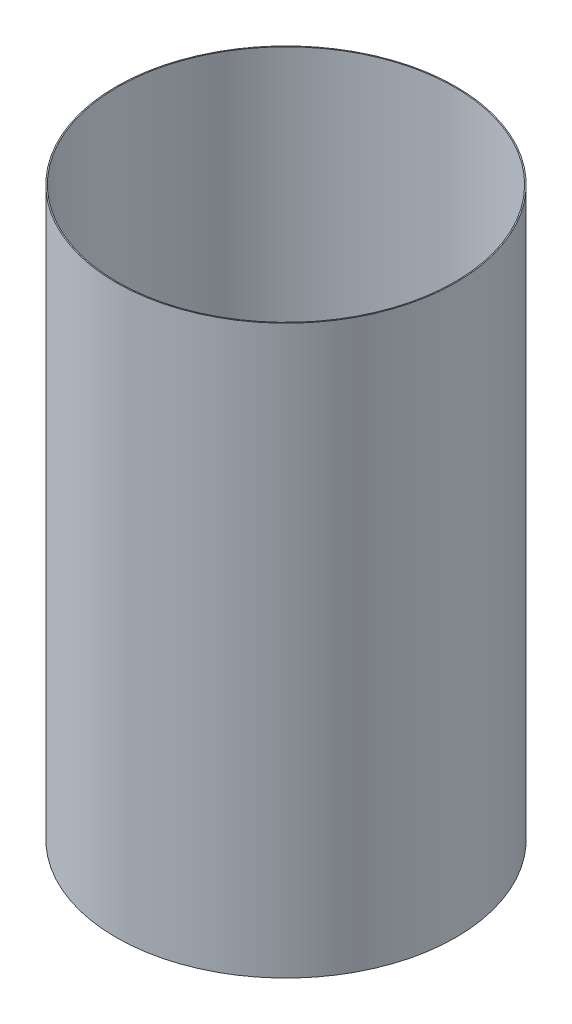
ISO-10303-21;
HEADER;
FILE_DESCRIPTION(('STEP AP214'),'2;1');
FILE_NAME('part.step','',(''),(''),'','','');
FILE_SCHEMA(('AUTOMOTIVE_DESIGN { 1 0 10303 214 1 1 1 1 }'));
ENDSEC;
DATA;
#1=APPLICATION_CONTEXT('core data for automotive mechanical design processes');
#2=APPLICATION_PROTOCOL_DEFINITION('international standard','automotive_design',2000,#1);
#3=PRODUCT_CONTEXT('',#1,'mechanical');
#4=PRODUCT('Part','Part','',(#3));
#5=PRODUCT_RELATED_PRODUCT_CATEGORY('part','',(#4));
#6=PRODUCT_DEFINITION_FORMATION('','',#4);
#7=PRODUCT_DEFINITION_CONTEXT('part definition',#1,'design');
#8=PRODUCT_DEFINITION('design','',#6,#7);
#9=PRODUCT_DEFINITION_SHAPE('','',#8);
#10=(LENGTH_UNIT() NAMED_UNIT(*) SI_UNIT(.MILLI.,.METRE.));
#11=(NAMED_UNIT(*) PLANE_ANGLE_UNIT() SI_UNIT($,.RADIAN.));
#12=(NAMED_UNIT(*) SI_UNIT($,.STERADIAN.) SOLID_ANGLE_UNIT());
#13=UNCERTAINTY_MEASURE_WITH_UNIT(LENGTH_MEASURE(1.E-05),#10,'distance_accuracy_value','');
#14=(GEOMETRIC_REPRESENTATION_CONTEXT(3) GLOBAL_UNCERTAINTY_ASSIGNED_CONTEXT((#13)) GLOBAL_UNIT_ASSIGNED_CONTEXT((#10,
#11,#12)) REPRESENTATION_CONTEXT('',''));
#15=CARTESIAN_POINT('',(0.,0.,0.));
#16=DIRECTION('',(0.,0.,1.));
#17=DIRECTION('',(1.,0.,0.));
#18=AXIS2_PLACEMENT_3D('',#15,#16,#17);
#19=CARTESIAN_POINT('',(0.,55.,0.));
#20=DIRECTION('',(0.,1.,0.));
#21=DIRECTION('',(0.,0.,1.));
#22=AXIS2_PLACEMENT_3D('',#19,#20,#21);
#23=CYLINDRICAL_SURFACE('',#22,39.93515);
#24=CARTESIAN_POINT('',(0.,-202.353193409573,0.));
#25=DIRECTION('',(0.,1.,0.));
#26=DIRECTION('',(0.,0.,1.));
#27=AXIS2_PLACEMENT_3D('',#24,#25,#26);
#28=CIRCLE('',#27,39.93515);
#29=CARTESIAN_POINT('',(0.,-202.353193409573,39.93515));
#30=VERTEX_POINT('',#29);
#31=EDGE_CURVE('E44',#30,#30,#28,.T.);
#32=ORIENTED_EDGE('',*,*,#31,.T.);
#33=EDGE_LOOP('',(#32));
#34=FACE_BOUND('',#33,.T.);
#35=CARTESIAN_POINT('',(0.,-69.0031934095732,0.));
#36=DIRECTION('',(0.,1.,0.));
#37=DIRECTION('',(0.,0.,1.));
#38=AXIS2_PLACEMENT_3D('',#35,#36,#37);
#39=CIRCLE('',#38,39.93515);
#40=CARTESIAN_POINT('',(0.,-69.0031934095732,39.93515));
#41=VERTEX_POINT('',#40);
#42=EDGE_CURVE('E10',#41,#41,#39,.T.);
#43=ORIENTED_EDGE('',*,*,#42,.F.);
#44=EDGE_LOOP('',(#43));
#45=FACE_BOUND('',#44,.T.);
#46=ADVANCED_FACE('F30',(#34,#45),#23,.T.);
#47=CARTESIAN_POINT('',(-39.93515,-69.0031934095732,0.));
#48=DIRECTION('',(0.,-1.,0.));
#49=DIRECTION('',(0.,0.,-1.));
#50=AXIS2_PLACEMENT_3D('',#47,#48,#49);
#51=PLANE('',#50);
#52=CARTESIAN_POINT('',(0.,-69.0031934095732,0.));
#53=DIRECTION('',(0.,1.,0.));
#54=DIRECTION('',(0.,0.,1.));
#55=AXIS2_PLACEMENT_3D('',#52,#53,#54);
#56=CIRCLE('',#55,39.68115);
#57=CARTESIAN_POINT('',(0.,-69.0031934095732,39.68115));
#58=VERTEX_POINT('',#57);
#59=EDGE_CURVE('E36',#58,#58,#56,.T.);
#60=ORIENTED_EDGE('',*,*,#59,.F.);
#61=EDGE_LOOP('',(#60));
#62=FACE_BOUND('',#61,.T.);
#63=ORIENTED_EDGE('',*,*,#42,.T.);
#64=EDGE_LOOP('',(#63));
#65=FACE_BOUND('',#64,.T.);
#66=ADVANCED_FACE('F60',(#62,#65),#51,.F.);
#67=CARTESIAN_POINT('',(0.,55.,0.));
#68=DIRECTION('',(0.,1.,0.));
#69=DIRECTION('',(0.,0.,1.));
#70=AXIS2_PLACEMENT_3D('',#67,#68,#69);
#71=CYLINDRICAL_SURFACE('',#70,39.68115);
#72=CARTESIAN_POINT('',(0.,-202.353193409573,0.));
#73=DIRECTION('',(0.,1.,0.));
#74=DIRECTION('',(0.,0.,1.));
#75=AXIS2_PLACEMENT_3D('',#72,#73,#74);
#76=CIRCLE('',#75,39.68115);
#77=CARTESIAN_POINT('',(0.,-202.353193409573,39.68115));
#78=VERTEX_POINT('',#77);
#79=EDGE_CURVE('E40',#78,#78,#76,.T.);
#80=ORIENTED_EDGE('',*,*,#79,.F.);
#81=EDGE_LOOP('',(#80));
#82=FACE_BOUND('',#81,.T.);
#83=ORIENTED_EDGE('',*,*,#59,.T.);
#84=EDGE_LOOP('',(#83));
#85=FACE_BOUND('',#84,.T.);
#86=ADVANCED_FACE('F55',(#82,#85),#71,.F.);
#87=CARTESIAN_POINT('',(-39.68115,-202.353193409573,0.));
#88=DIRECTION('',(0.,1.,0.));
#89=DIRECTION('',(0.,0.,1.));
#90=AXIS2_PLACEMENT_3D('',#87,#88,#89);
#91=PLANE('',#90);
#92=ORIENTED_EDGE('',*,*,#31,.F.);
#93=EDGE_LOOP('',(#92));
#94=FACE_BOUND('',#93,.T.);
#95=ORIENTED_EDGE('',*,*,#79,.T.);
#96=EDGE_LOOP('',(#95));
#97=FACE_BOUND('',#96,.T.);
#98=ADVANCED_FACE('F52',(#94,#97),#91,.F.);
#99=CLOSED_SHELL('',(#46,#66,#86,#98));
#100=MANIFOLD_SOLID_BREP('B2',#99);
#101=ADVANCED_BREP_SHAPE_REPRESENTATION('',(#18,#100),#14);
#102=SHAPE_DEFINITION_REPRESENTATION(#9,#101);
ENDSEC;
END-ISO-10303-21;
